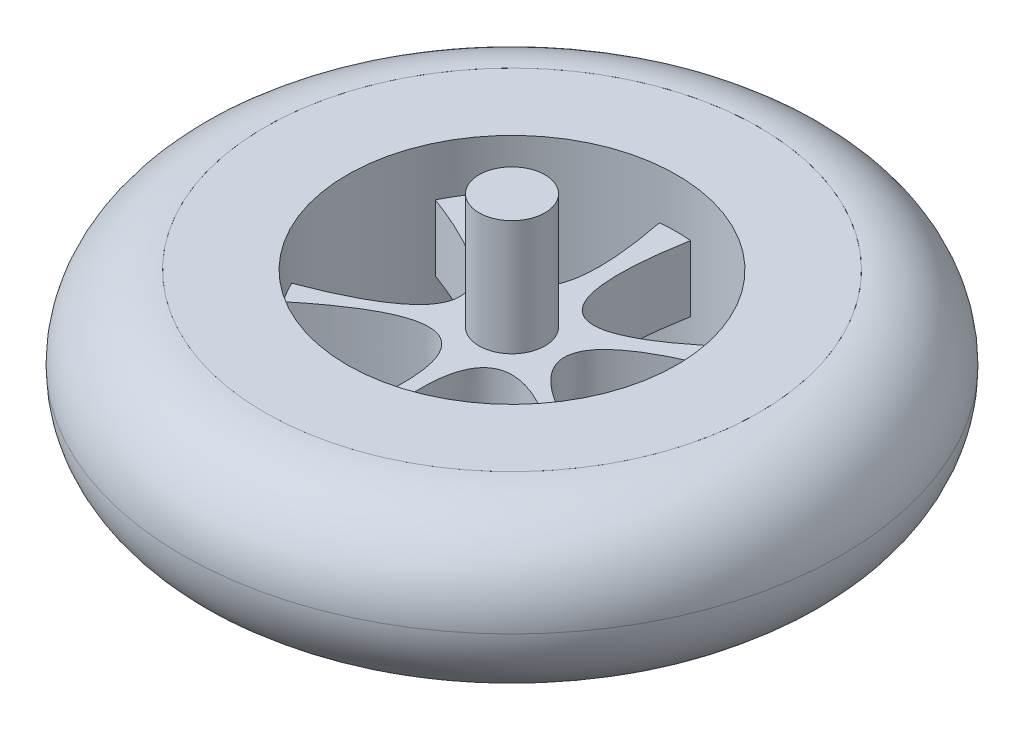
ISO-10303-21;
HEADER;
FILE_DESCRIPTION(('STEP AP214'),'2;1');
FILE_NAME('part.step','',(''),(''),'','','');
FILE_SCHEMA(('AUTOMOTIVE_DESIGN { 1 0 10303 214 1 1 1 1 }'));
ENDSEC;
DATA;
#1=APPLICATION_CONTEXT('core data for automotive mechanical design processes');
#2=APPLICATION_PROTOCOL_DEFINITION('international standard','automotive_design',2000,#1);
#3=PRODUCT_CONTEXT('',#1,'mechanical');
#4=PRODUCT('Part','Part','',(#3));
#5=PRODUCT_RELATED_PRODUCT_CATEGORY('part','',(#4));
#6=PRODUCT_DEFINITION_FORMATION('','',#4);
#7=PRODUCT_DEFINITION_CONTEXT('part definition',#1,'design');
#8=PRODUCT_DEFINITION('design','',#6,#7);
#9=PRODUCT_DEFINITION_SHAPE('','',#8);
#10=(LENGTH_UNIT() NAMED_UNIT(*) SI_UNIT(.MILLI.,.METRE.));
#11=(NAMED_UNIT(*) PLANE_ANGLE_UNIT() SI_UNIT($,.RADIAN.));
#12=(NAMED_UNIT(*) SI_UNIT($,.STERADIAN.) SOLID_ANGLE_UNIT());
#13=UNCERTAINTY_MEASURE_WITH_UNIT(LENGTH_MEASURE(1.E-05),#10,'distance_accuracy_value','');
#14=(GEOMETRIC_REPRESENTATION_CONTEXT(3) GLOBAL_UNCERTAINTY_ASSIGNED_CONTEXT((#13)) GLOBAL_UNIT_ASSIGNED_CONTEXT((#10,
#11,#12)) REPRESENTATION_CONTEXT('',''));
#15=CARTESIAN_POINT('',(0.,0.,0.));
#16=DIRECTION('',(0.,0.,1.));
#17=DIRECTION('',(1.,0.,0.));
#18=AXIS2_PLACEMENT_3D('',#15,#16,#17);
#19=CARTESIAN_POINT('',(0.,-11.7191249046558,0.));
#20=DIRECTION('',(0.,-1.,0.));
#21=DIRECTION('',(0.,0.,-1.));
#22=AXIS2_PLACEMENT_3D('',#19,#20,#21);
#23=CYLINDRICAL_SURFACE('',#22,15.);
#24=CARTESIAN_POINT('',(0.,-5.,0.));
#25=DIRECTION('',(0.,-1.,0.));
#26=DIRECTION('',(0.,0.,-1.));
#27=AXIS2_PLACEMENT_3D('',#24,#25,#26);
#28=CIRCLE('',#27,15.);
#29=CARTESIAN_POINT('',(0.,-5.,-15.));
#30=VERTEX_POINT('',#29);
#31=EDGE_CURVE('E11',#30,#30,#28,.T.);
#32=ORIENTED_EDGE('',*,*,#31,.T.);
#33=EDGE_LOOP('',(#32));
#34=FACE_BOUND('',#33,.T.);
#35=CARTESIAN_POINT('',(0.,5.,0.));
#36=DIRECTION('',(0.,-1.,0.));
#37=DIRECTION('',(0.,0.,-1.));
#38=AXIS2_PLACEMENT_3D('',#35,#36,#37);
#39=CIRCLE('',#38,15.);
#40=CARTESIAN_POINT('',(0.,5.,-15.));
#41=VERTEX_POINT('',#40);
#42=EDGE_CURVE('E56',#41,#41,#39,.T.);
#43=ORIENTED_EDGE('',*,*,#42,.F.);
#44=EDGE_LOOP('',(#43));
#45=FACE_BOUND('',#44,.T.);
#46=ADVANCED_FACE('F48',(#34,#45),#23,.F.);
#47=CARTESIAN_POINT('',(0.,0.,0.));
#48=DIRECTION('',(0.,1.,0.));
#49=DIRECTION('',(0.,0.,1.));
#50=AXIS2_PLACEMENT_3D('',#47,#48,#49);
#51=TOROIDAL_SURFACE('',#50,15.,5.);
#52=ORIENTED_EDGE('',*,*,#42,.T.);
#53=EDGE_LOOP('',(#52));
#54=FACE_BOUND('',#53,.T.);
#55=CARTESIAN_POINT('',(0.,0.,0.));
#56=DIRECTION('',(0.,1.,0.));
#57=DIRECTION('',(0.,0.,1.));
#58=AXIS2_PLACEMENT_3D('',#55,#56,#57);
#59=CIRCLE('',#58,20.);
#60=CARTESIAN_POINT('',(0.,0.,20.));
#61=VERTEX_POINT('',#60);
#62=EDGE_CURVE('E52',#61,#61,#59,.F.);
#63=ORIENTED_EDGE('',*,*,#62,.F.);
#64=EDGE_LOOP('',(#63));
#65=FACE_BOUND('',#64,.T.);
#66=ADVANCED_FACE('F50',(#54,#65),#51,.T.);
#67=CARTESIAN_POINT('',(0.,0.,0.));
#68=DIRECTION('',(0.,-1.,0.));
#69=DIRECTION('',(0.,0.,-1.));
#70=AXIS2_PLACEMENT_3D('',#67,#68,#69);
#71=TOROIDAL_SURFACE('',#70,15.,5.);
#72=ORIENTED_EDGE('',*,*,#62,.T.);
#73=EDGE_LOOP('',(#72));
#74=FACE_BOUND('',#73,.T.);
#75=ORIENTED_EDGE('',*,*,#31,.F.);
#76=EDGE_LOOP('',(#75));
#77=FACE_BOUND('',#76,.T.);
#78=ADVANCED_FACE('F66',(#74,#77),#71,.T.);
#79=CLOSED_SHELL('',(#46,#66,#78));
#80=MANIFOLD_SOLID_BREP('B2',#79);
#81=CARTESIAN_POINT('',(0.,-2.,0.));
#82=DIRECTION('',(0.,-1.,0.));
#83=DIRECTION('',(0.,0.,1.));
#84=AXIS2_PLACEMENT_3D('',#81,#82,#83);
#85=PLANE('',#84);
#86=CARTESIAN_POINT('',(0.,-2.,0.));
#87=DIRECTION('',(0.,-1.,0.));
#88=DIRECTION('',(0.,0.,-1.));
#89=AXIS2_PLACEMENT_3D('',#86,#87,#88);
#90=CIRCLE('',#89,2.);
#91=CARTESIAN_POINT('',(0.,-2.,-2.));
#92=VERTEX_POINT('',#91);
#93=EDGE_CURVE('E46',#92,#92,#90,.T.);
#94=ORIENTED_EDGE('',*,*,#93,.F.);
#95=EDGE_LOOP('',(#94));
#96=FACE_BOUND('',#95,.T.);
#97=CARTESIAN_POINT('',(0.,-2.,0.));
#98=DIRECTION('',(0.,1.,0.));
#99=DIRECTION('',(0.,0.,1.));
#100=AXIS2_PLACEMENT_3D('',#97,#98,#99);
#101=CIRCLE('',#100,10.);
#102=CARTESIAN_POINT('',(8.27198371748414,-2.,5.61910005051319));
#103=VERTEX_POINT('',#102);
#104=CARTESIAN_POINT('',(8.98586768194854,-2.,4.38795875123191));
#105=VERTEX_POINT('',#104);
#106=EDGE_CURVE('E216',#103,#105,#101,.T.);
#107=ORIENTED_EDGE('',*,*,#106,.F.);
#108=CARTESIAN_POINT('',(8.27198371748414,-2.,5.61910005051319));
#109=CARTESIAN_POINT('',(-1.37962920333846,-2.,-2.2920447688445));
#110=CARTESIAN_POINT('',(0.877109656010826,-2.,9.96145966469435));
#111=B_SPLINE_CURVE_WITH_KNOTS('',2,(#108,#109,#110),.UNSPECIFIED.,.F.,.F.,(3,3),(0.,1.),.UNSPECIFIED.);
#112=CARTESIAN_POINT('',(0.877109656010826,-2.,9.96145966469435));
#113=VERTEX_POINT('',#112);
#114=EDGE_CURVE('E399',#103,#113,#111,.T.);
#115=ORIENTED_EDGE('',*,*,#114,.T.);
#116=CARTESIAN_POINT('',(-0.710984409300723,-2.,9.97469303636615));
#117=VERTEX_POINT('',#116);
#118=EDGE_CURVE('E219',#117,#113,#101,.T.);
#119=ORIENTED_EDGE('',*,*,#118,.F.);
#120=CARTESIAN_POINT('',(-0.710984409300725,-2.,9.97469303636615));
#121=CARTESIAN_POINT('',(1.31499436717315,-2.,-2.28784682708713));
#122=CARTESIAN_POINT('',(-8.27198371748414,-2.,5.61910005051319));
#123=B_SPLINE_CURVE_WITH_KNOTS('',2,(#120,#121,#122),.UNSPECIFIED.,.F.,.F.,(3,3),(0.,1.),.UNSPECIFIED.);
#124=CARTESIAN_POINT('',(-8.27198371748414,-2.,5.61910005051319));
#125=VERTEX_POINT('',#124);
#126=EDGE_CURVE('E389',#117,#125,#123,.T.);
#127=ORIENTED_EDGE('',*,*,#126,.T.);
#128=CARTESIAN_POINT('',(-8.98586768194854,-2.,4.38795875123191));
#129=VERTEX_POINT('',#128);
#130=EDGE_CURVE('E218',#129,#125,#101,.T.);
#131=ORIENTED_EDGE('',*,*,#130,.F.);
#132=CARTESIAN_POINT('',(-8.98586768194854,-2.,4.38795875123191));
#133=CARTESIAN_POINT('',(2.63491032024017,-2.,-0.0126597359035218));
#134=CARTESIAN_POINT('',(-9.0023904347318,-2.,-4.35395985978848));
#135=B_SPLINE_CURVE_WITH_KNOTS('',2,(#132,#133,#134),.UNSPECIFIED.,.F.,.F.,(3,3),(0.,1.),.UNSPECIFIED.);
#136=CARTESIAN_POINT('',(-9.0023904347318,-2.,-4.35395985978848));
#137=VERTEX_POINT('',#136);
#138=EDGE_CURVE('E418',#129,#137,#135,.T.);
#139=ORIENTED_EDGE('',*,*,#138,.T.);
#140=CARTESIAN_POINT('',(-8.27198371748414,-2.,-5.61910005051319));
#141=VERTEX_POINT('',#140);
#142=EDGE_CURVE('E214',#141,#137,#101,.T.);
#143=ORIENTED_EDGE('',*,*,#142,.F.);
#144=CARTESIAN_POINT('',(-8.27198371748414,-2.,-5.61910005051319));
#145=CARTESIAN_POINT('',(1.43048401365609,-2.,2.29309128944146));
#146=CARTESIAN_POINT('',(-1.00123274449756,-2.,-9.94975039844447));
#147=B_SPLINE_CURVE_WITH_KNOTS('',2,(#144,#145,#146),.UNSPECIFIED.,.F.,.F.,(3,3),(0.,1.),.UNSPECIFIED.);
#148=CARTESIAN_POINT('',(-1.00123274449756,-2.,-9.94975039844447));
#149=VERTEX_POINT('',#148);
#150=EDGE_CURVE('E212',#141,#149,#147,.T.);
#151=ORIENTED_EDGE('',*,*,#150,.T.);
#152=CARTESIAN_POINT('',(0.877109656010825,-2.,-9.96145966469436));
#153=VERTEX_POINT('',#152);
#154=EDGE_CURVE('E190',#153,#149,#101,.T.);
#155=ORIENTED_EDGE('',*,*,#154,.F.);
#156=CARTESIAN_POINT('',(0.877109656010826,-2.,-9.96145966469435));
#157=CARTESIAN_POINT('',(-1.3065829012374,-2.,2.42721017856025));
#158=CARTESIAN_POINT('',(8.05003142843639,-2.,-5.9327054537695));
#159=B_SPLINE_CURVE_WITH_KNOTS('',2,(#156,#157,#158),.UNSPECIFIED.,.F.,.F.,(3,3),(0.,1.),.UNSPECIFIED.);
#160=CARTESIAN_POINT('',(8.05003142843639,-2.,-5.9327054537695));
#161=VERTEX_POINT('',#160);
#162=EDGE_CURVE('E200',#153,#161,#159,.T.);
#163=ORIENTED_EDGE('',*,*,#162,.T.);
#164=CARTESIAN_POINT('',(9.0023904347318,-2.,-4.35395985978849));
#165=VERTEX_POINT('',#164);
#166=EDGE_CURVE('E213',#165,#161,#101,.T.);
#167=ORIENTED_EDGE('',*,*,#166,.F.);
#168=CARTESIAN_POINT('',(9.0023904347318,-2.,-4.35395985978848));
#169=CARTESIAN_POINT('',(-2.63491917966981,-2.,-0.0140461527442225));
#170=CARTESIAN_POINT('',(8.98586768194854,-2.,4.38795875123191));
#171=B_SPLINE_CURVE_WITH_KNOTS('',2,(#168,#169,#170),.UNSPECIFIED.,.F.,.F.,(3,3),(0.,1.),.UNSPECIFIED.);
#172=EDGE_CURVE('E205',#165,#105,#171,.T.);
#173=ORIENTED_EDGE('',*,*,#172,.T.);
#174=EDGE_LOOP('',(#107,#115,#119,#127,#131,#139,#143,#151,#155,#163,#167,#173));
#175=FACE_BOUND('',#174,.T.);
#176=ADVANCED_FACE('F94',(#96,#175),#85,.T.);
#177=CARTESIAN_POINT('',(0.,5.,0.));
#178=DIRECTION('',(0.,-1.,0.));
#179=DIRECTION('',(0.,0.,-1.));
#180=AXIS2_PLACEMENT_3D('',#177,#178,#179);
#181=CYLINDRICAL_SURFACE('',#180,15.);
#182=CARTESIAN_POINT('',(0.,5.,0.));
#183=DIRECTION('',(0.,1.,0.));
#184=DIRECTION('',(0.,0.,1.));
#185=AXIS2_PLACEMENT_3D('',#182,#183,#184);
#186=CIRCLE('',#185,15.);
#187=CARTESIAN_POINT('',(0.,5.,15.));
#188=VERTEX_POINT('',#187);
#189=EDGE_CURVE('E102',#188,#188,#186,.T.);
#190=ORIENTED_EDGE('',*,*,#189,.F.);
#191=EDGE_LOOP('',(#190));
#192=FACE_BOUND('',#191,.T.);
#193=CARTESIAN_POINT('',(0.,-5.,0.));
#194=DIRECTION('',(0.,1.,0.));
#195=DIRECTION('',(0.,0.,1.));
#196=AXIS2_PLACEMENT_3D('',#193,#194,#195);
#197=CIRCLE('',#196,15.);
#198=CARTESIAN_POINT('',(0.,-5.,15.));
#199=VERTEX_POINT('',#198);
#200=EDGE_CURVE('E229',#199,#199,#197,.T.);
#201=ORIENTED_EDGE('',*,*,#200,.T.);
#202=EDGE_LOOP('',(#201));
#203=FACE_BOUND('',#202,.T.);
#204=ADVANCED_FACE('F96',(#192,#203),#181,.T.);
#205=CARTESIAN_POINT('',(0.,5.,0.));
#206=DIRECTION('',(0.,1.,0.));
#207=DIRECTION('',(0.,0.,1.));
#208=AXIS2_PLACEMENT_3D('',#205,#206,#207);
#209=PLANE('',#208);
#210=CARTESIAN_POINT('',(0.,5.,0.));
#211=DIRECTION('',(0.,1.,0.));
#212=DIRECTION('',(0.,0.,1.));
#213=AXIS2_PLACEMENT_3D('',#210,#211,#212);
#214=CIRCLE('',#213,10.);
#215=CARTESIAN_POINT('',(0.,5.,10.));
#216=VERTEX_POINT('',#215);
#217=EDGE_CURVE('E356',#216,#216,#214,.T.);
#218=ORIENTED_EDGE('',*,*,#217,.F.);
#219=EDGE_LOOP('',(#218));
#220=FACE_BOUND('',#219,.T.);
#221=ORIENTED_EDGE('',*,*,#189,.T.);
#222=EDGE_LOOP('',(#221));
#223=FACE_BOUND('',#222,.T.);
#224=ADVANCED_FACE('F440',(#220,#223),#209,.T.);
#225=CARTESIAN_POINT('',(0.,2.,0.));
#226=DIRECTION('',(0.,1.,0.));
#227=DIRECTION('',(0.,0.,1.));
#228=AXIS2_PLACEMENT_3D('',#225,#226,#227);
#229=CYLINDRICAL_SURFACE('',#228,10.);
#230=DIRECTION('',(0.,1.,0.));
#231=VECTOR('',#230,1.);
#232=CARTESIAN_POINT('',(8.27198371748414,0.,5.61910005051319));
#233=LINE('',#232,#231);
#234=CARTESIAN_POINT('',(8.27198371748414,2.,5.61910005051319));
#235=VERTEX_POINT('',#234);
#236=EDGE_CURVE('E296',#103,#235,#233,.T.);
#237=ORIENTED_EDGE('',*,*,#236,.F.);
#238=ORIENTED_EDGE('',*,*,#106,.T.);
#239=DIRECTION('',(0.,1.,0.));
#240=VECTOR('',#239,1.);
#241=CARTESIAN_POINT('',(8.98586768194854,0.,4.38795875123191));
#242=LINE('',#241,#240);
#243=CARTESIAN_POINT('',(8.98586768194854,2.,4.38795875123191));
#244=VERTEX_POINT('',#243);
#245=EDGE_CURVE('E277',#105,#244,#242,.T.);
#246=ORIENTED_EDGE('',*,*,#245,.T.);
#247=CARTESIAN_POINT('',(0.,2.,0.));
#248=DIRECTION('',(0.,1.,0.));
#249=DIRECTION('',(0.,0.,1.));
#250=AXIS2_PLACEMENT_3D('',#247,#248,#249);
#251=CIRCLE('',#250,10.);
#252=EDGE_CURVE('E362',#235,#244,#251,.T.);
#253=ORIENTED_EDGE('',*,*,#252,.F.);
#254=EDGE_LOOP('',(#237,#238,#246,#253));
#255=FACE_BOUND('',#254,.T.);
#256=DIRECTION('',(0.,1.,0.));
#257=VECTOR('',#256,1.);
#258=CARTESIAN_POINT('',(9.0023904347318,0.,-4.35395985978849));
#259=LINE('',#258,#257);
#260=CARTESIAN_POINT('',(9.0023904347318,2.,-4.35395985978848));
#261=VERTEX_POINT('',#260);
#262=EDGE_CURVE('E278',#165,#261,#259,.T.);
#263=ORIENTED_EDGE('',*,*,#262,.F.);
#264=ORIENTED_EDGE('',*,*,#166,.T.);
#265=DIRECTION('',(0.,1.,0.));
#266=VECTOR('',#265,1.);
#267=CARTESIAN_POINT('',(8.05003142843639,0.,-5.9327054537695));
#268=LINE('',#267,#266);
#269=CARTESIAN_POINT('',(8.05003142843639,2.,-5.9327054537695));
#270=VERTEX_POINT('',#269);
#271=EDGE_CURVE('E197',#161,#270,#268,.T.);
#272=ORIENTED_EDGE('',*,*,#271,.T.);
#273=EDGE_CURVE('E368',#261,#270,#251,.T.);
#274=ORIENTED_EDGE('',*,*,#273,.F.);
#275=EDGE_LOOP('',(#263,#264,#272,#274));
#276=FACE_BOUND('',#275,.T.);
#277=DIRECTION('',(0.,1.,0.));
#278=VECTOR('',#277,1.);
#279=CARTESIAN_POINT('',(-8.98586768194854,0.,4.38795875123191));
#280=LINE('',#279,#278);
#281=CARTESIAN_POINT('',(-8.98586768194854,2.,4.38795875123191));
#282=VERTEX_POINT('',#281);
#283=EDGE_CURVE('E333',#129,#282,#280,.T.);
#284=ORIENTED_EDGE('',*,*,#283,.F.);
#285=ORIENTED_EDGE('',*,*,#130,.T.);
#286=DIRECTION('',(0.,1.,0.));
#287=VECTOR('',#286,1.);
#288=CARTESIAN_POINT('',(-8.27198371748414,0.,5.61910005051319));
#289=LINE('',#288,#287);
#290=CARTESIAN_POINT('',(-8.27198371748414,2.,5.61910005051319));
#291=VERTEX_POINT('',#290);
#292=EDGE_CURVE('E109',#125,#291,#289,.T.);
#293=ORIENTED_EDGE('',*,*,#292,.T.);
#294=EDGE_CURVE('E361',#282,#291,#251,.T.);
#295=ORIENTED_EDGE('',*,*,#294,.F.);
#296=EDGE_LOOP('',(#284,#285,#293,#295));
#297=FACE_BOUND('',#296,.T.);
#298=DIRECTION('',(0.,1.,0.));
#299=VECTOR('',#298,1.);
#300=CARTESIAN_POINT('',(-0.710984409300723,0.,9.97469303636615));
#301=LINE('',#300,#299);
#302=CARTESIAN_POINT('',(-0.710984409300725,2.,9.97469303636615));
#303=VERTEX_POINT('',#302);
#304=EDGE_CURVE('E332',#117,#303,#301,.T.);
#305=ORIENTED_EDGE('',*,*,#304,.F.);
#306=ORIENTED_EDGE('',*,*,#118,.T.);
#307=DIRECTION('',(0.,1.,0.));
#308=VECTOR('',#307,1.);
#309=CARTESIAN_POINT('',(0.877109656010826,0.,9.96145966469436));
#310=LINE('',#309,#308);
#311=CARTESIAN_POINT('',(0.877109656010826,2.,9.96145966469436));
#312=VERTEX_POINT('',#311);
#313=EDGE_CURVE('E295',#113,#312,#310,.T.);
#314=ORIENTED_EDGE('',*,*,#313,.T.);
#315=EDGE_CURVE('E358',#303,#312,#251,.T.);
#316=ORIENTED_EDGE('',*,*,#315,.F.);
#317=EDGE_LOOP('',(#305,#306,#314,#316));
#318=FACE_BOUND('',#317,.T.);
#319=DIRECTION('',(0.,1.,0.));
#320=VECTOR('',#319,1.);
#321=CARTESIAN_POINT('',(0.877109656010825,0.,-9.96145966469436));
#322=LINE('',#321,#320);
#323=CARTESIAN_POINT('',(0.877109656010826,2.,-9.96145966469435));
#324=VERTEX_POINT('',#323);
#325=EDGE_CURVE('E185',#153,#324,#322,.T.);
#326=ORIENTED_EDGE('',*,*,#325,.F.);
#327=ORIENTED_EDGE('',*,*,#154,.T.);
#328=DIRECTION('',(0.,1.,0.));
#329=VECTOR('',#328,1.);
#330=CARTESIAN_POINT('',(-1.00123274449756,0.,-9.94975039844447));
#331=LINE('',#330,#329);
#332=CARTESIAN_POINT('',(-1.00123274449756,2.,-9.94975039844447));
#333=VERTEX_POINT('',#332);
#334=EDGE_CURVE('E350',#149,#333,#331,.T.);
#335=ORIENTED_EDGE('',*,*,#334,.T.);
#336=EDGE_CURVE('E192',#324,#333,#251,.T.);
#337=ORIENTED_EDGE('',*,*,#336,.F.);
#338=EDGE_LOOP('',(#326,#327,#335,#337));
#339=FACE_BOUND('',#338,.T.);
#340=ORIENTED_EDGE('',*,*,#142,.T.);
#341=DIRECTION('',(0.,1.,0.));
#342=VECTOR('',#341,1.);
#343=CARTESIAN_POINT('',(-9.0023904347318,0.,-4.35395985978848));
#344=LINE('',#343,#342);
#345=CARTESIAN_POINT('',(-9.0023904347318,2.,-4.35395985978848));
#346=VERTEX_POINT('',#345);
#347=EDGE_CURVE('E117',#137,#346,#344,.T.);
#348=ORIENTED_EDGE('',*,*,#347,.T.);
#349=CARTESIAN_POINT('',(-8.27198371748414,2.,-5.61910005051319));
#350=VERTEX_POINT('',#349);
#351=EDGE_CURVE('E375',#350,#346,#251,.T.);
#352=ORIENTED_EDGE('',*,*,#351,.F.);
#353=DIRECTION('',(0.,1.,0.));
#354=VECTOR('',#353,1.);
#355=CARTESIAN_POINT('',(-8.27198371748414,0.,-5.61910005051319));
#356=LINE('',#355,#354);
#357=EDGE_CURVE('E351',#141,#350,#356,.T.);
#358=ORIENTED_EDGE('',*,*,#357,.F.);
#359=EDGE_LOOP('',(#340,#348,#352,#358));
#360=FACE_BOUND('',#359,.T.);
#361=ORIENTED_EDGE('',*,*,#217,.T.);
#362=EDGE_LOOP('',(#361));
#363=FACE_BOUND('',#362,.T.);
#364=CARTESIAN_POINT('',(0.,-5.,0.));
#365=DIRECTION('',(0.,1.,0.));
#366=DIRECTION('',(0.,0.,1.));
#367=AXIS2_PLACEMENT_3D('',#364,#365,#366);
#368=CIRCLE('',#367,10.);
#369=CARTESIAN_POINT('',(0.,-5.,10.));
#370=VERTEX_POINT('',#369);
#371=EDGE_CURVE('E223',#370,#370,#368,.T.);
#372=ORIENTED_EDGE('',*,*,#371,.F.);
#373=EDGE_LOOP('',(#372));
#374=FACE_BOUND('',#373,.T.);
#375=ADVANCED_FACE('F187',(#255,#276,#297,#318,#339,#360,#363,#374),#229,.F.);
#376=CARTESIAN_POINT('',(0.,2.,0.));
#377=DIRECTION('',(0.,1.,0.));
#378=DIRECTION('',(0.,0.,1.));
#379=AXIS2_PLACEMENT_3D('',#376,#377,#378);
#380=PLANE('',#379);
#381=CARTESIAN_POINT('',(0.,2.,0.));
#382=DIRECTION('',(0.,1.,0.));
#383=DIRECTION('',(0.,0.,1.));
#384=AXIS2_PLACEMENT_3D('',#381,#382,#383);
#385=CIRCLE('',#384,2.);
#386=CARTESIAN_POINT('',(0.,2.,2.));
#387=VERTEX_POINT('',#386);
#388=EDGE_CURVE('E232',#387,#387,#385,.T.);
#389=ORIENTED_EDGE('',*,*,#388,.F.);
#390=EDGE_LOOP('',(#389));
#391=FACE_BOUND('',#390,.T.);
#392=CARTESIAN_POINT('',(8.27198371748414,2.,5.61910005051319));
#393=CARTESIAN_POINT('',(-1.37962920333846,2.,-2.2920447688445));
#394=CARTESIAN_POINT('',(0.877109656010826,2.,9.96145966469435));
#395=B_SPLINE_CURVE_WITH_KNOTS('',2,(#392,#393,#394),.UNSPECIFIED.,.F.,.F.,(3,3),(0.,1.),.UNSPECIFIED.);
#396=EDGE_CURVE('E283',#235,#312,#395,.T.);
#397=ORIENTED_EDGE('',*,*,#396,.F.);
#398=ORIENTED_EDGE('',*,*,#252,.T.);
#399=CARTESIAN_POINT('',(9.0023904347318,2.,-4.35395985978848));
#400=CARTESIAN_POINT('',(-2.63491917966981,2.,-0.0140461527442225));
#401=CARTESIAN_POINT('',(8.98586768194854,2.,4.38795875123191));
#402=B_SPLINE_CURVE_WITH_KNOTS('',2,(#399,#400,#401),.UNSPECIFIED.,.F.,.F.,(3,3),(0.,1.),.UNSPECIFIED.);
#403=EDGE_CURVE('E196',#261,#244,#402,.T.);
#404=ORIENTED_EDGE('',*,*,#403,.F.);
#405=ORIENTED_EDGE('',*,*,#273,.T.);
#406=CARTESIAN_POINT('',(0.877109656010826,2.,-9.96145966469435));
#407=CARTESIAN_POINT('',(-1.3065829012374,2.,2.42721017856025));
#408=CARTESIAN_POINT('',(8.05003142843639,2.,-5.9327054537695));
#409=B_SPLINE_CURVE_WITH_KNOTS('',2,(#406,#407,#408),.UNSPECIFIED.,.F.,.F.,(3,3),(0.,1.),.UNSPECIFIED.);
#410=EDGE_CURVE('E236',#324,#270,#409,.T.);
#411=ORIENTED_EDGE('',*,*,#410,.F.);
#412=ORIENTED_EDGE('',*,*,#336,.T.);
#413=CARTESIAN_POINT('',(-8.27198371748414,2.,-5.61910005051319));
#414=CARTESIAN_POINT('',(1.43048401365609,2.,2.29309128944146));
#415=CARTESIAN_POINT('',(-1.00123274449756,2.,-9.94975039844447));
#416=B_SPLINE_CURVE_WITH_KNOTS('',2,(#413,#414,#415),.UNSPECIFIED.,.F.,.F.,(3,3),(0.,1.),.UNSPECIFIED.);
#417=EDGE_CURVE('E338',#350,#333,#416,.T.);
#418=ORIENTED_EDGE('',*,*,#417,.F.);
#419=ORIENTED_EDGE('',*,*,#351,.T.);
#420=CARTESIAN_POINT('',(-8.98586768194854,2.,4.38795875123191));
#421=CARTESIAN_POINT('',(2.63491032024017,2.,-0.0126597359035218));
#422=CARTESIAN_POINT('',(-9.0023904347318,2.,-4.35395985978848));
#423=B_SPLINE_CURVE_WITH_KNOTS('',2,(#420,#421,#422),.UNSPECIFIED.,.F.,.F.,(3,3),(0.,1.),.UNSPECIFIED.);
#424=EDGE_CURVE('E325',#282,#346,#423,.T.);
#425=ORIENTED_EDGE('',*,*,#424,.F.);
#426=ORIENTED_EDGE('',*,*,#294,.T.);
#427=CARTESIAN_POINT('',(-0.710984409300725,2.,9.97469303636615));
#428=CARTESIAN_POINT('',(1.31499436717315,2.,-2.28784682708713));
#429=CARTESIAN_POINT('',(-8.27198371748414,2.,5.61910005051319));
#430=B_SPLINE_CURVE_WITH_KNOTS('',2,(#427,#428,#429),.UNSPECIFIED.,.F.,.F.,(3,3),(0.,1.),.UNSPECIFIED.);
#431=EDGE_CURVE('E301',#303,#291,#430,.T.);
#432=ORIENTED_EDGE('',*,*,#431,.F.);
#433=ORIENTED_EDGE('',*,*,#315,.T.);
#434=EDGE_LOOP('',(#397,#398,#404,#405,#411,#412,#418,#419,#425,#426,#432,#433));
#435=FACE_BOUND('',#434,.T.);
#436=ADVANCED_FACE('F383',(#391,#435),#380,.T.);
#437=CARTESIAN_POINT('',(-8.27198371748414,0.,-5.61910005051319));
#438=CARTESIAN_POINT('',(1.43048401365609,0.,2.29309128944146));
#439=CARTESIAN_POINT('',(-1.00123274449756,0.,-9.94975039844447));
#440=B_SPLINE_CURVE_WITH_KNOTS('',2,(#437,#438,#439),.UNSPECIFIED.,.F.,.F.,(3,3),(0.,1.),.UNSPECIFIED.);
#441=DIRECTION('',(0.,1.,0.));
#442=VECTOR('',#441,1.);
#443=SURFACE_OF_LINEAR_EXTRUSION('',#440,#442);
#444=ORIENTED_EDGE('',*,*,#417,.T.);
#445=ORIENTED_EDGE('',*,*,#334,.F.);
#446=ORIENTED_EDGE('',*,*,#150,.F.);
#447=ORIENTED_EDGE('',*,*,#357,.T.);
#448=EDGE_LOOP('',(#444,#445,#446,#447));
#449=FACE_BOUND('',#448,.T.);
#450=ADVANCED_FACE('F253',(#449),#443,.F.);
#451=CARTESIAN_POINT('',(0.877109656010826,0.,-9.96145966469435));
#452=CARTESIAN_POINT('',(-1.3065829012374,0.,2.42721017856025));
#453=CARTESIAN_POINT('',(8.05003142843639,0.,-5.9327054537695));
#454=B_SPLINE_CURVE_WITH_KNOTS('',2,(#451,#452,#453),.UNSPECIFIED.,.F.,.F.,(3,3),(0.,1.),.UNSPECIFIED.);
#455=DIRECTION('',(0.,1.,0.));
#456=VECTOR('',#455,1.);
#457=SURFACE_OF_LINEAR_EXTRUSION('',#454,#456);
#458=ORIENTED_EDGE('',*,*,#410,.T.);
#459=ORIENTED_EDGE('',*,*,#271,.F.);
#460=ORIENTED_EDGE('',*,*,#162,.F.);
#461=ORIENTED_EDGE('',*,*,#325,.T.);
#462=EDGE_LOOP('',(#458,#459,#460,#461));
#463=FACE_BOUND('',#462,.T.);
#464=ADVANCED_FACE('F201',(#463),#457,.F.);
#465=CARTESIAN_POINT('',(-0.710984409300725,0.,9.97469303636615));
#466=CARTESIAN_POINT('',(1.31499436717315,0.,-2.28784682708713));
#467=CARTESIAN_POINT('',(-8.27198371748414,0.,5.61910005051319));
#468=B_SPLINE_CURVE_WITH_KNOTS('',2,(#465,#466,#467),.UNSPECIFIED.,.F.,.F.,(3,3),(0.,1.),.UNSPECIFIED.);
#469=DIRECTION('',(0.,1.,0.));
#470=VECTOR('',#469,1.);
#471=SURFACE_OF_LINEAR_EXTRUSION('',#468,#470);
#472=ORIENTED_EDGE('',*,*,#431,.T.);
#473=ORIENTED_EDGE('',*,*,#292,.F.);
#474=ORIENTED_EDGE('',*,*,#126,.F.);
#475=ORIENTED_EDGE('',*,*,#304,.T.);
#476=EDGE_LOOP('',(#472,#473,#474,#475));
#477=FACE_BOUND('',#476,.T.);
#478=ADVANCED_FACE('F252',(#477),#471,.F.);
#479=CARTESIAN_POINT('',(-8.98586768194854,0.,4.38795875123191));
#480=CARTESIAN_POINT('',(2.63491032024017,0.,-0.0126597359035218));
#481=CARTESIAN_POINT('',(-9.0023904347318,0.,-4.35395985978848));
#482=B_SPLINE_CURVE_WITH_KNOTS('',2,(#479,#480,#481),.UNSPECIFIED.,.F.,.F.,(3,3),(0.,1.),.UNSPECIFIED.);
#483=DIRECTION('',(0.,1.,0.));
#484=VECTOR('',#483,1.);
#485=SURFACE_OF_LINEAR_EXTRUSION('',#482,#484);
#486=ORIENTED_EDGE('',*,*,#424,.T.);
#487=ORIENTED_EDGE('',*,*,#347,.F.);
#488=ORIENTED_EDGE('',*,*,#138,.F.);
#489=ORIENTED_EDGE('',*,*,#283,.T.);
#490=EDGE_LOOP('',(#486,#487,#488,#489));
#491=FACE_BOUND('',#490,.T.);
#492=ADVANCED_FACE('F261',(#491),#485,.F.);
#493=CARTESIAN_POINT('',(9.0023904347318,0.,-4.35395985978848));
#494=CARTESIAN_POINT('',(-2.63491917966981,0.,-0.0140461527442225));
#495=CARTESIAN_POINT('',(8.98586768194854,0.,4.38795875123191));
#496=B_SPLINE_CURVE_WITH_KNOTS('',2,(#493,#494,#495),.UNSPECIFIED.,.F.,.F.,(3,3),(0.,1.),.UNSPECIFIED.);
#497=DIRECTION('',(0.,1.,0.));
#498=VECTOR('',#497,1.);
#499=SURFACE_OF_LINEAR_EXTRUSION('',#496,#498);
#500=ORIENTED_EDGE('',*,*,#403,.T.);
#501=ORIENTED_EDGE('',*,*,#245,.F.);
#502=ORIENTED_EDGE('',*,*,#172,.F.);
#503=ORIENTED_EDGE('',*,*,#262,.T.);
#504=EDGE_LOOP('',(#500,#501,#502,#503));
#505=FACE_BOUND('',#504,.T.);
#506=ADVANCED_FACE('F256',(#505),#499,.F.);
#507=CARTESIAN_POINT('',(8.27198371748414,0.,5.61910005051319));
#508=CARTESIAN_POINT('',(-1.37962920333846,0.,-2.2920447688445));
#509=CARTESIAN_POINT('',(0.877109656010826,0.,9.96145966469435));
#510=B_SPLINE_CURVE_WITH_KNOTS('',2,(#507,#508,#509),.UNSPECIFIED.,.F.,.F.,(3,3),(0.,1.),.UNSPECIFIED.);
#511=DIRECTION('',(0.,1.,0.));
#512=VECTOR('',#511,1.);
#513=SURFACE_OF_LINEAR_EXTRUSION('',#510,#512);
#514=ORIENTED_EDGE('',*,*,#396,.T.);
#515=ORIENTED_EDGE('',*,*,#313,.F.);
#516=ORIENTED_EDGE('',*,*,#114,.F.);
#517=ORIENTED_EDGE('',*,*,#236,.T.);
#518=EDGE_LOOP('',(#514,#515,#516,#517));
#519=FACE_BOUND('',#518,.T.);
#520=ADVANCED_FACE('F260',(#519),#513,.F.);
#521=CARTESIAN_POINT('',(0.,9.,0.));
#522=DIRECTION('',(0.,-1.,0.));
#523=DIRECTION('',(0.,0.,-1.));
#524=AXIS2_PLACEMENT_3D('',#521,#522,#523);
#525=CYLINDRICAL_SURFACE('',#524,2.);
#526=CARTESIAN_POINT('',(0.,9.,0.));
#527=DIRECTION('',(0.,1.,0.));
#528=DIRECTION('',(0.,0.,1.));
#529=AXIS2_PLACEMENT_3D('',#526,#527,#528);
#530=CIRCLE('',#529,2.);
#531=CARTESIAN_POINT('',(0.,9.,2.));
#532=VERTEX_POINT('',#531);
#533=EDGE_CURVE('E233',#532,#532,#530,.T.);
#534=ORIENTED_EDGE('',*,*,#533,.F.);
#535=EDGE_LOOP('',(#534));
#536=FACE_BOUND('',#535,.T.);
#537=ORIENTED_EDGE('',*,*,#388,.T.);
#538=EDGE_LOOP('',(#537));
#539=FACE_BOUND('',#538,.T.);
#540=ADVANCED_FACE('F254',(#536,#539),#525,.T.);
#541=CARTESIAN_POINT('',(0.,9.,0.));
#542=DIRECTION('',(0.,1.,0.));
#543=DIRECTION('',(0.,0.,1.));
#544=AXIS2_PLACEMENT_3D('',#541,#542,#543);
#545=PLANE('',#544);
#546=ORIENTED_EDGE('',*,*,#533,.T.);
#547=EDGE_LOOP('',(#546));
#548=FACE_BOUND('',#547,.T.);
#549=ADVANCED_FACE('F449',(#548),#545,.T.);
#550=CARTESIAN_POINT('',(0.,-5.,0.));
#551=DIRECTION('',(0.,-1.,0.));
#552=DIRECTION('',(0.,0.,1.));
#553=AXIS2_PLACEMENT_3D('',#550,#551,#552);
#554=PLANE('',#553);
#555=ORIENTED_EDGE('',*,*,#371,.T.);
#556=EDGE_LOOP('',(#555));
#557=FACE_BOUND('',#556,.T.);
#558=ORIENTED_EDGE('',*,*,#200,.F.);
#559=EDGE_LOOP('',(#558));
#560=FACE_BOUND('',#559,.T.);
#561=ADVANCED_FACE('F447',(#557,#560),#554,.T.);
#562=CARTESIAN_POINT('',(0.,-9.,0.));
#563=DIRECTION('',(0.,1.,0.));
#564=DIRECTION('',(0.,0.,1.));
#565=AXIS2_PLACEMENT_3D('',#562,#563,#564);
#566=CYLINDRICAL_SURFACE('',#565,2.);
#567=CARTESIAN_POINT('',(0.,-9.,0.));
#568=DIRECTION('',(0.,1.,0.));
#569=DIRECTION('',(0.,0.,1.));
#570=AXIS2_PLACEMENT_3D('',#567,#568,#569);
#571=CIRCLE('',#570,2.);
#572=CARTESIAN_POINT('',(0.,-9.,2.));
#573=VERTEX_POINT('',#572);
#574=EDGE_CURVE('E206',#573,#573,#571,.T.);
#575=ORIENTED_EDGE('',*,*,#574,.T.);
#576=EDGE_LOOP('',(#575));
#577=FACE_BOUND('',#576,.T.);
#578=ORIENTED_EDGE('',*,*,#93,.T.);
#579=EDGE_LOOP('',(#578));
#580=FACE_BOUND('',#579,.T.);
#581=ADVANCED_FACE('F445',(#577,#580),#566,.T.);
#582=CARTESIAN_POINT('',(0.,-9.,0.));
#583=DIRECTION('',(0.,-1.,0.));
#584=DIRECTION('',(0.,0.,1.));
#585=AXIS2_PLACEMENT_3D('',#582,#583,#584);
#586=PLANE('',#585);
#587=ORIENTED_EDGE('',*,*,#574,.F.);
#588=EDGE_LOOP('',(#587));
#589=FACE_BOUND('',#588,.T.);
#590=ADVANCED_FACE('F590',(#589),#586,.T.);
#591=CLOSED_SHELL('',(#176,#204,#224,#375,#436,#450,#464,#478,#492,#506,#520,#540,#549,#561,
#581,#590));
#592=MANIFOLD_SOLID_BREP('B6',#591);
#593=ADVANCED_BREP_SHAPE_REPRESENTATION('',(#18,#80,#592),#14);
#594=SHAPE_DEFINITION_REPRESENTATION(#9,#593);
ENDSEC;
END-ISO-10303-21;
